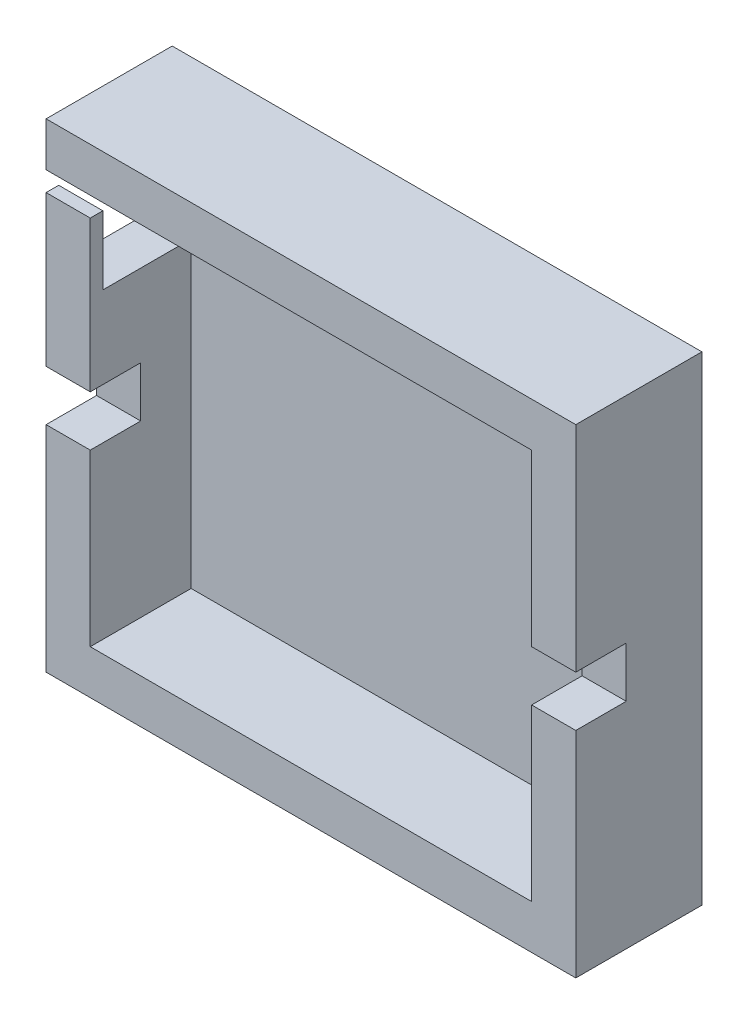
ISO-10303-21;
HEADER;
FILE_DESCRIPTION(('STEP AP214'),'2;1');
FILE_NAME('part.step','',(''),(''),'','','');
FILE_SCHEMA(('AUTOMOTIVE_DESIGN { 1 0 10303 214 1 1 1 1 }'));
ENDSEC;
DATA;
#1=APPLICATION_CONTEXT('core data for automotive mechanical design processes');
#2=APPLICATION_PROTOCOL_DEFINITION('international standard','automotive_design',2000,#1);
#3=PRODUCT_CONTEXT('',#1,'mechanical');
#4=PRODUCT('Part','Part','',(#3));
#5=PRODUCT_RELATED_PRODUCT_CATEGORY('part','',(#4));
#6=PRODUCT_DEFINITION_FORMATION('','',#4);
#7=PRODUCT_DEFINITION_CONTEXT('part definition',#1,'design');
#8=PRODUCT_DEFINITION('design','',#6,#7);
#9=PRODUCT_DEFINITION_SHAPE('','',#8);
#10=(LENGTH_UNIT() NAMED_UNIT(*) SI_UNIT(.MILLI.,.METRE.));
#11=(NAMED_UNIT(*) PLANE_ANGLE_UNIT() SI_UNIT($,.RADIAN.));
#12=(NAMED_UNIT(*) SI_UNIT($,.STERADIAN.) SOLID_ANGLE_UNIT());
#13=UNCERTAINTY_MEASURE_WITH_UNIT(LENGTH_MEASURE(1.E-05),#10,'distance_accuracy_value','');
#14=(GEOMETRIC_REPRESENTATION_CONTEXT(3) GLOBAL_UNCERTAINTY_ASSIGNED_CONTEXT((#13)) GLOBAL_UNIT_ASSIGNED_CONTEXT((#10,
#11,#12)) REPRESENTATION_CONTEXT('',''));
#15=CARTESIAN_POINT('',(0.,0.,0.));
#16=DIRECTION('',(0.,0.,1.));
#17=DIRECTION('',(1.,0.,0.));
#18=AXIS2_PLACEMENT_3D('',#15,#16,#17);
#19=CARTESIAN_POINT('',(-3.5,-3.5,2.));
#20=DIRECTION('',(1.,0.,0.));
#21=DIRECTION('',(0.,1.,0.));
#22=AXIS2_PLACEMENT_3D('',#19,#20,#21);
#23=PLANE('',#22);
#24=DIRECTION('',(0.,0.,1.));
#25=VECTOR('',#24,1.);
#26=CARTESIAN_POINT('',(-3.5,13.4999999999999,5.99999999999994));
#27=LINE('',#26,#25);
#28=CARTESIAN_POINT('',(-3.5,13.4999999999999,5.99999999999994));
#29=VERTEX_POINT('',#28);
#30=CARTESIAN_POINT('',(-3.5,13.4999999999998,10.));
#31=VERTEX_POINT('',#30);
#32=EDGE_CURVE('E260',#29,#31,#27,.T.);
#33=ORIENTED_EDGE('',*,*,#32,.F.);
#34=DIRECTION('',(0.,-1.,0.));
#35=VECTOR('',#34,1.);
#36=CARTESIAN_POINT('',(-3.5,0.,6.));
#37=LINE('',#36,#35);
#38=CARTESIAN_POINT('',(-3.5,17.4999999999998,6.));
#39=VERTEX_POINT('',#38);
#40=EDGE_CURVE('E248',#39,#29,#37,.T.);
#41=ORIENTED_EDGE('',*,*,#40,.F.);
#42=DIRECTION('',(0.,0.,1.));
#43=VECTOR('',#42,1.);
#44=CARTESIAN_POINT('',(-3.5,17.4999999999998,6.));
#45=LINE('',#44,#43);
#46=CARTESIAN_POINT('',(-3.5,17.5,10.));
#47=VERTEX_POINT('',#46);
#48=EDGE_CURVE('E264',#39,#47,#45,.T.);
#49=ORIENTED_EDGE('',*,*,#48,.T.);
#50=DIRECTION('',(0.,-1.,0.));
#51=VECTOR('',#50,1.);
#52=CARTESIAN_POINT('',(-3.5,-3.5,10.));
#53=LINE('',#52,#51);
#54=CARTESIAN_POINT('',(-3.5,29.4354205615971,9.99999999999989));
#55=VERTEX_POINT('',#54);
#56=EDGE_CURVE('E388',#55,#47,#53,.T.);
#57=ORIENTED_EDGE('',*,*,#56,.F.);
#58=DIRECTION('',(0.,0.,1.));
#59=VECTOR('',#58,1.);
#60=CARTESIAN_POINT('',(-3.5,29.4354205615971,8.99999999999989));
#61=LINE('',#60,#59);
#62=CARTESIAN_POINT('',(-3.5,29.4354205615971,8.99999999999989));
#63=VERTEX_POINT('',#62);
#64=EDGE_CURVE('E263',#63,#55,#61,.T.);
#65=ORIENTED_EDGE('',*,*,#64,.F.);
#66=DIRECTION('',(0.,-1.,0.));
#67=VECTOR('',#66,1.);
#68=CARTESIAN_POINT('',(-3.5,0.,9.));
#69=LINE('',#68,#67);
#70=CARTESIAN_POINT('',(-3.5,23.9999999999998,9.));
#71=VERTEX_POINT('',#70);
#72=EDGE_CURVE('E308',#63,#71,#69,.T.);
#73=ORIENTED_EDGE('',*,*,#72,.T.);
#74=DIRECTION('',(0.,0.,1.));
#75=VECTOR('',#74,1.);
#76=CARTESIAN_POINT('',(-3.5,23.9999999999998,0.));
#77=LINE('',#76,#75);
#78=CARTESIAN_POINT('',(-3.5,23.9999999999998,2.));
#79=VERTEX_POINT('',#78);
#80=EDGE_CURVE('E321',#79,#71,#77,.T.);
#81=ORIENTED_EDGE('',*,*,#80,.F.);
#82=DIRECTION('',(0.,-1.,0.));
#83=VECTOR('',#82,1.);
#84=CARTESIAN_POINT('',(-3.5,0.,2.));
#85=LINE('',#84,#83);
#86=CARTESIAN_POINT('',(-3.5,30.9999999999998,2.));
#87=VERTEX_POINT('',#86);
#88=EDGE_CURVE('E317',#87,#79,#85,.T.);
#89=ORIENTED_EDGE('',*,*,#88,.F.);
#90=DIRECTION('',(0.,0.,1.));
#91=VECTOR('',#90,1.);
#92=CARTESIAN_POINT('',(-3.5,30.9999999999998,0.));
#93=LINE('',#92,#91);
#94=CARTESIAN_POINT('',(-3.5,31.,10.));
#95=VERTEX_POINT('',#94);
#96=EDGE_CURVE('E312',#87,#95,#93,.T.);
#97=ORIENTED_EDGE('',*,*,#96,.T.);
#98=CARTESIAN_POINT('',(-3.5,34.5,10.));
#99=VERTEX_POINT('',#98);
#100=EDGE_CURVE('E383',#99,#95,#53,.T.);
#101=ORIENTED_EDGE('',*,*,#100,.F.);
#102=DIRECTION('',(0.,0.,-1.));
#103=VECTOR('',#102,1.);
#104=CARTESIAN_POINT('',(-3.5,34.5,2.));
#105=LINE('',#104,#103);
#106=CARTESIAN_POINT('',(-3.5,34.5,0.));
#107=VERTEX_POINT('',#106);
#108=EDGE_CURVE('E414',#99,#107,#105,.T.);
#109=ORIENTED_EDGE('',*,*,#108,.T.);
#110=DIRECTION('',(0.,-1.,0.));
#111=VECTOR('',#110,1.);
#112=CARTESIAN_POINT('',(-3.5,-3.5,0.));
#113=LINE('',#112,#111);
#114=CARTESIAN_POINT('',(-3.5,-3.5,0.));
#115=VERTEX_POINT('',#114);
#116=EDGE_CURVE('E401',#107,#115,#113,.T.);
#117=ORIENTED_EDGE('',*,*,#116,.T.);
#118=DIRECTION('',(0.,0.,-1.));
#119=VECTOR('',#118,1.);
#120=CARTESIAN_POINT('',(-3.5,-3.5,2.));
#121=LINE('',#120,#119);
#122=CARTESIAN_POINT('',(-3.5,-3.5,10.));
#123=VERTEX_POINT('',#122);
#124=EDGE_CURVE('E426',#123,#115,#121,.T.);
#125=ORIENTED_EDGE('',*,*,#124,.F.);
#126=EDGE_CURVE('E382',#31,#123,#53,.T.);
#127=ORIENTED_EDGE('',*,*,#126,.F.);
#128=EDGE_LOOP('',(#33,#41,#49,#57,#65,#73,#81,#89,#97,#101,#109,#117,#125,#127));
#129=FACE_BOUND('',#128,.T.);
#130=ADVANCED_FACE('F38',(#129),#23,.F.);
#131=CARTESIAN_POINT('',(0.,0.,10.));
#132=DIRECTION('',(0.,0.,-1.));
#133=DIRECTION('',(-1.,0.,0.));
#134=AXIS2_PLACEMENT_3D('',#131,#132,#133);
#135=PLANE('',#134);
#136=DIRECTION('',(-1.,0.,0.));
#137=VECTOR('',#136,1.);
#138=CARTESIAN_POINT('',(0.,13.4999999999998,10.));
#139=LINE('',#138,#137);
#140=CARTESIAN_POINT('',(0.,13.4999999999998,10.));
#141=VERTEX_POINT('',#140);
#142=EDGE_CURVE('E253',#141,#31,#139,.T.);
#143=ORIENTED_EDGE('',*,*,#142,.T.);
#144=ORIENTED_EDGE('',*,*,#126,.T.);
#145=DIRECTION('',(1.,0.,0.));
#146=VECTOR('',#145,1.);
#147=CARTESIAN_POINT('',(-3.5,-3.5,10.));
#148=LINE('',#147,#146);
#149=CARTESIAN_POINT('',(38.5,-3.5,10.));
#150=VERTEX_POINT('',#149);
#151=EDGE_CURVE('E387',#123,#150,#148,.T.);
#152=ORIENTED_EDGE('',*,*,#151,.T.);
#153=DIRECTION('',(0.,1.,0.));
#154=VECTOR('',#153,1.);
#155=CARTESIAN_POINT('',(38.5,-3.5,10.));
#156=LINE('',#155,#154);
#157=CARTESIAN_POINT('',(38.5,13.4999999999998,10.));
#158=VERTEX_POINT('',#157);
#159=EDGE_CURVE('E393',#150,#158,#156,.T.);
#160=ORIENTED_EDGE('',*,*,#159,.T.);
#161=DIRECTION('',(1.,0.,0.));
#162=VECTOR('',#161,1.);
#163=CARTESIAN_POINT('',(0.,13.4999999999998,10.));
#164=LINE('',#163,#162);
#165=CARTESIAN_POINT('',(35.,13.4999999999998,10.));
#166=VERTEX_POINT('',#165);
#167=EDGE_CURVE('E231',#166,#158,#164,.T.);
#168=ORIENTED_EDGE('',*,*,#167,.F.);
#169=DIRECTION('',(0.,1.,0.));
#170=VECTOR('',#169,1.);
#171=CARTESIAN_POINT('',(35.,0.,10.));
#172=LINE('',#171,#170);
#173=CARTESIAN_POINT('',(35.,0.,10.));
#174=VERTEX_POINT('',#173);
#175=EDGE_CURVE('E352',#174,#166,#172,.T.);
#176=ORIENTED_EDGE('',*,*,#175,.F.);
#177=DIRECTION('',(1.,0.,0.));
#178=VECTOR('',#177,1.);
#179=CARTESIAN_POINT('',(0.,0.,10.));
#180=LINE('',#179,#178);
#181=CARTESIAN_POINT('',(0.,0.,10.));
#182=VERTEX_POINT('',#181);
#183=EDGE_CURVE('E347',#182,#174,#180,.T.);
#184=ORIENTED_EDGE('',*,*,#183,.F.);
#185=DIRECTION('',(0.,-1.,0.));
#186=VECTOR('',#185,1.);
#187=CARTESIAN_POINT('',(0.,0.,10.));
#188=LINE('',#187,#186);
#189=EDGE_CURVE('E348',#141,#182,#188,.T.);
#190=ORIENTED_EDGE('',*,*,#189,.F.);
#191=EDGE_LOOP('',(#143,#144,#152,#160,#168,#176,#184,#190));
#192=FACE_BOUND('',#191,.T.);
#193=ADVANCED_FACE('F467',(#192),#135,.F.);
#194=DIRECTION('',(1.,0.,0.));
#195=VECTOR('',#194,1.);
#196=CARTESIAN_POINT('',(0.,17.5,10.));
#197=LINE('',#196,#195);
#198=CARTESIAN_POINT('',(35.,17.5,10.));
#199=VERTEX_POINT('',#198);
#200=CARTESIAN_POINT('',(38.5,17.5,9.99999999999989));
#201=VERTEX_POINT('',#200);
#202=EDGE_CURVE('E279',#199,#201,#197,.T.);
#203=ORIENTED_EDGE('',*,*,#202,.T.);
#204=CARTESIAN_POINT('',(38.5,34.4999999999996,9.99999999999989));
#205=VERTEX_POINT('',#204);
#206=EDGE_CURVE('E392',#201,#205,#156,.T.);
#207=ORIENTED_EDGE('',*,*,#206,.T.);
#208=DIRECTION('',(-1.,0.,0.));
#209=VECTOR('',#208,1.);
#210=CARTESIAN_POINT('',(-3.5,34.5,10.));
#211=LINE('',#210,#209);
#212=EDGE_CURVE('E397',#205,#99,#211,.T.);
#213=ORIENTED_EDGE('',*,*,#212,.T.);
#214=ORIENTED_EDGE('',*,*,#100,.T.);
#215=DIRECTION('',(-1.,0.,0.));
#216=VECTOR('',#215,1.);
#217=CARTESIAN_POINT('',(0.,31.,10.));
#218=LINE('',#217,#216);
#219=CARTESIAN_POINT('',(35.,31.,10.));
#220=VERTEX_POINT('',#219);
#221=EDGE_CURVE('E356',#220,#95,#218,.T.);
#222=ORIENTED_EDGE('',*,*,#221,.F.);
#223=EDGE_CURVE('E351',#199,#220,#172,.T.);
#224=ORIENTED_EDGE('',*,*,#223,.F.);
#225=EDGE_LOOP('',(#203,#207,#213,#214,#222,#224));
#226=FACE_BOUND('',#225,.T.);
#227=ADVANCED_FACE('F472',(#226),#135,.F.);
#228=CARTESIAN_POINT('',(38.5,-3.5,1.99999999999989));
#229=DIRECTION('',(-1.,0.,0.));
#230=DIRECTION('',(0.,0.,1.));
#231=AXIS2_PLACEMENT_3D('',#228,#229,#230);
#232=PLANE('',#231);
#233=DIRECTION('',(0.,0.,1.));
#234=VECTOR('',#233,1.);
#235=CARTESIAN_POINT('',(38.5,17.4999999999998,5.99999999999994));
#236=LINE('',#235,#234);
#237=CARTESIAN_POINT('',(38.5,17.4999999999998,5.99999999999994));
#238=VERTEX_POINT('',#237);
#239=EDGE_CURVE('E299',#238,#201,#236,.T.);
#240=ORIENTED_EDGE('',*,*,#239,.F.);
#241=DIRECTION('',(0.,1.,0.));
#242=VECTOR('',#241,1.);
#243=CARTESIAN_POINT('',(38.5,0.,5.99999999999994));
#244=LINE('',#243,#242);
#245=CARTESIAN_POINT('',(38.5,13.4999999999999,5.99999999999994));
#246=VERTEX_POINT('',#245);
#247=EDGE_CURVE('E283',#246,#238,#244,.T.);
#248=ORIENTED_EDGE('',*,*,#247,.F.);
#249=DIRECTION('',(0.,0.,1.));
#250=VECTOR('',#249,1.);
#251=CARTESIAN_POINT('',(38.5,13.4999999999999,5.99999999999994));
#252=LINE('',#251,#250);
#253=EDGE_CURVE('E302',#246,#158,#252,.T.);
#254=ORIENTED_EDGE('',*,*,#253,.T.);
#255=ORIENTED_EDGE('',*,*,#159,.F.);
#256=DIRECTION('',(0.,0.,-1.));
#257=VECTOR('',#256,1.);
#258=CARTESIAN_POINT('',(38.5,-3.5,1.99999999999989));
#259=LINE('',#258,#257);
#260=CARTESIAN_POINT('',(38.5,-3.5,-1.11022302462516E-13));
#261=VERTEX_POINT('',#260);
#262=EDGE_CURVE('E422',#150,#261,#259,.T.);
#263=ORIENTED_EDGE('',*,*,#262,.T.);
#264=DIRECTION('',(0.,1.,0.));
#265=VECTOR('',#264,1.);
#266=CARTESIAN_POINT('',(38.5,-3.5,-1.11022302462516E-13));
#267=LINE('',#266,#265);
#268=CARTESIAN_POINT('',(38.5,34.4999999999996,-1.11022302462516E-13));
#269=VERTEX_POINT('',#268);
#270=EDGE_CURVE('E408',#261,#269,#267,.T.);
#271=ORIENTED_EDGE('',*,*,#270,.T.);
#272=DIRECTION('',(0.,0.,-1.));
#273=VECTOR('',#272,1.);
#274=CARTESIAN_POINT('',(38.5,34.4999999999996,2.));
#275=LINE('',#274,#273);
#276=EDGE_CURVE('E418',#205,#269,#275,.T.);
#277=ORIENTED_EDGE('',*,*,#276,.F.);
#278=ORIENTED_EDGE('',*,*,#206,.F.);
#279=EDGE_LOOP('',(#240,#248,#254,#255,#263,#271,#277,#278));
#280=FACE_BOUND('',#279,.T.);
#281=ADVANCED_FACE('F569',(#280),#232,.F.);
#282=CARTESIAN_POINT('',(0.,0.,10.));
#283=DIRECTION('',(1.,0.,0.));
#284=DIRECTION('',(0.,0.,-1.));
#285=AXIS2_PLACEMENT_3D('',#282,#283,#284);
#286=PLANE('',#285);
#287=DIRECTION('',(0.,1.,0.));
#288=VECTOR('',#287,1.);
#289=CARTESIAN_POINT('',(0.,0.,5.99999999999994));
#290=LINE('',#289,#288);
#291=CARTESIAN_POINT('',(0.,13.4999999999999,6.));
#292=VERTEX_POINT('',#291);
#293=CARTESIAN_POINT('',(0.,17.4999999999998,5.99999999999994));
#294=VERTEX_POINT('',#293);
#295=EDGE_CURVE('E239',#292,#294,#290,.T.);
#296=ORIENTED_EDGE('',*,*,#295,.F.);
#297=DIRECTION('',(0.,0.,1.));
#298=VECTOR('',#297,1.);
#299=CARTESIAN_POINT('',(0.,13.4999999999999,6.));
#300=LINE('',#299,#298);
#301=EDGE_CURVE('E252',#292,#141,#300,.T.);
#302=ORIENTED_EDGE('',*,*,#301,.T.);
#303=ORIENTED_EDGE('',*,*,#189,.T.);
#304=DIRECTION('',(0.,0.,-1.));
#305=VECTOR('',#304,1.);
#306=CARTESIAN_POINT('',(0.,0.,10.));
#307=LINE('',#306,#305);
#308=CARTESIAN_POINT('',(0.,0.,2.));
#309=VERTEX_POINT('',#308);
#310=EDGE_CURVE('E378',#182,#309,#307,.T.);
#311=ORIENTED_EDGE('',*,*,#310,.T.);
#312=DIRECTION('',(0.,-1.,0.));
#313=VECTOR('',#312,1.);
#314=CARTESIAN_POINT('',(0.,0.,2.));
#315=LINE('',#314,#313);
#316=CARTESIAN_POINT('',(0.,23.9999999999998,2.));
#317=VERTEX_POINT('',#316);
#318=EDGE_CURVE('E342',#317,#309,#315,.T.);
#319=ORIENTED_EDGE('',*,*,#318,.F.);
#320=DIRECTION('',(0.,0.,-1.));
#321=VECTOR('',#320,1.);
#322=CARTESIAN_POINT('',(0.,23.9999999999998,9.99999999999989));
#323=LINE('',#322,#321);
#324=CARTESIAN_POINT('',(0.,23.9999999999998,8.99999999999989));
#325=VERTEX_POINT('',#324);
#326=EDGE_CURVE('E336',#325,#317,#323,.T.);
#327=ORIENTED_EDGE('',*,*,#326,.F.);
#328=DIRECTION('',(0.,1.,0.));
#329=VECTOR('',#328,1.);
#330=CARTESIAN_POINT('',(0.,0.,9.));
#331=LINE('',#330,#329);
#332=CARTESIAN_POINT('',(0.,29.4354205615971,9.));
#333=VERTEX_POINT('',#332);
#334=EDGE_CURVE('E433',#325,#333,#331,.T.);
#335=ORIENTED_EDGE('',*,*,#334,.T.);
#336=DIRECTION('',(0.,0.,-1.));
#337=VECTOR('',#336,1.);
#338=CARTESIAN_POINT('',(0.,29.4354205615971,10.));
#339=LINE('',#338,#337);
#340=CARTESIAN_POINT('',(0.,29.4354205615971,10.));
#341=VERTEX_POINT('',#340);
#342=EDGE_CURVE('E430',#341,#333,#339,.T.);
#343=ORIENTED_EDGE('',*,*,#342,.F.);
#344=CARTESIAN_POINT('',(0.,17.5,10.));
#345=VERTEX_POINT('',#344);
#346=EDGE_CURVE('E343',#341,#345,#188,.T.);
#347=ORIENTED_EDGE('',*,*,#346,.T.);
#348=DIRECTION('',(0.,0.,1.));
#349=VECTOR('',#348,1.);
#350=CARTESIAN_POINT('',(0.,17.4999999999998,5.99999999999994));
#351=LINE('',#350,#349);
#352=EDGE_CURVE('E268',#294,#345,#351,.T.);
#353=ORIENTED_EDGE('',*,*,#352,.F.);
#354=EDGE_LOOP('',(#296,#302,#303,#311,#319,#327,#335,#343,#347,#353));
#355=FACE_BOUND('',#354,.T.);
#356=ADVANCED_FACE('F597',(#355),#286,.T.);
#357=CARTESIAN_POINT('',(35.,0.,10.));
#358=DIRECTION('',(-1.,0.,0.));
#359=DIRECTION('',(0.,0.,1.));
#360=AXIS2_PLACEMENT_3D('',#357,#358,#359);
#361=PLANE('',#360);
#362=DIRECTION('',(0.,-1.,0.));
#363=VECTOR('',#362,1.);
#364=CARTESIAN_POINT('',(35.,0.,5.99999999999994));
#365=LINE('',#364,#363);
#366=CARTESIAN_POINT('',(35.,17.5,6.));
#367=VERTEX_POINT('',#366);
#368=CARTESIAN_POINT('',(35.,13.4999999999999,5.99999999999994));
#369=VERTEX_POINT('',#368);
#370=EDGE_CURVE('E274',#367,#369,#365,.T.);
#371=ORIENTED_EDGE('',*,*,#370,.F.);
#372=DIRECTION('',(0.,0.,1.));
#373=VECTOR('',#372,1.);
#374=CARTESIAN_POINT('',(35.,17.5,6.));
#375=LINE('',#374,#373);
#376=EDGE_CURVE('E257',#367,#199,#375,.T.);
#377=ORIENTED_EDGE('',*,*,#376,.T.);
#378=ORIENTED_EDGE('',*,*,#223,.T.);
#379=DIRECTION('',(0.,0.,-1.));
#380=VECTOR('',#379,1.);
#381=CARTESIAN_POINT('',(35.,31.,10.));
#382=LINE('',#381,#380);
#383=CARTESIAN_POINT('',(35.,30.9999999999998,2.));
#384=VERTEX_POINT('',#383);
#385=EDGE_CURVE('E359',#220,#384,#382,.T.);
#386=ORIENTED_EDGE('',*,*,#385,.T.);
#387=DIRECTION('',(0.,1.,0.));
#388=VECTOR('',#387,1.);
#389=CARTESIAN_POINT('',(35.,0.,1.99999999999989));
#390=LINE('',#389,#388);
#391=CARTESIAN_POINT('',(35.,0.,1.99999999999989));
#392=VERTEX_POINT('',#391);
#393=EDGE_CURVE('E366',#392,#384,#390,.T.);
#394=ORIENTED_EDGE('',*,*,#393,.F.);
#395=DIRECTION('',(0.,0.,-1.));
#396=VECTOR('',#395,1.);
#397=CARTESIAN_POINT('',(35.,0.,10.));
#398=LINE('',#397,#396);
#399=EDGE_CURVE('E375',#174,#392,#398,.T.);
#400=ORIENTED_EDGE('',*,*,#399,.F.);
#401=ORIENTED_EDGE('',*,*,#175,.T.);
#402=DIRECTION('',(0.,0.,1.));
#403=VECTOR('',#402,1.);
#404=CARTESIAN_POINT('',(35.,13.4999999999999,5.99999999999994));
#405=LINE('',#404,#403);
#406=EDGE_CURVE('E290',#369,#166,#405,.T.);
#407=ORIENTED_EDGE('',*,*,#406,.F.);
#408=EDGE_LOOP('',(#371,#377,#378,#386,#394,#400,#401,#407));
#409=FACE_BOUND('',#408,.T.);
#410=ADVANCED_FACE('F589',(#409),#361,.T.);
#411=ORIENTED_EDGE('',*,*,#56,.T.);
#412=DIRECTION('',(-1.,0.,0.));
#413=VECTOR('',#412,1.);
#414=CARTESIAN_POINT('',(0.,17.5,10.));
#415=LINE('',#414,#413);
#416=EDGE_CURVE('E240',#345,#47,#415,.T.);
#417=ORIENTED_EDGE('',*,*,#416,.F.);
#418=ORIENTED_EDGE('',*,*,#346,.F.);
#419=DIRECTION('',(-1.,0.,0.));
#420=VECTOR('',#419,1.);
#421=CARTESIAN_POINT('',(3.,29.4354205615971,10.));
#422=LINE('',#421,#420);
#423=EDGE_CURVE('E313',#341,#55,#422,.T.);
#424=ORIENTED_EDGE('',*,*,#423,.T.);
#425=EDGE_LOOP('',(#411,#417,#418,#424));
#426=FACE_BOUND('',#425,.T.);
#427=ADVANCED_FACE('F475',(#426),#135,.F.);
#428=CARTESIAN_POINT('',(-3.5,-3.5,2.));
#429=DIRECTION('',(0.,1.,0.));
#430=DIRECTION('',(0.,0.,1.));
#431=AXIS2_PLACEMENT_3D('',#428,#429,#430);
#432=PLANE('',#431);
#433=DIRECTION('',(1.,0.,0.));
#434=VECTOR('',#433,1.);
#435=CARTESIAN_POINT('',(-3.5,-3.5,0.));
#436=LINE('',#435,#434);
#437=EDGE_CURVE('E405',#115,#261,#436,.T.);
#438=ORIENTED_EDGE('',*,*,#437,.T.);
#439=ORIENTED_EDGE('',*,*,#262,.F.);
#440=ORIENTED_EDGE('',*,*,#151,.F.);
#441=ORIENTED_EDGE('',*,*,#124,.T.);
#442=EDGE_LOOP('',(#438,#439,#440,#441));
#443=FACE_BOUND('',#442,.T.);
#444=ADVANCED_FACE('F577',(#443),#432,.F.);
#445=CARTESIAN_POINT('',(-3.5,34.5,2.));
#446=DIRECTION('',(0.,-1.,0.));
#447=DIRECTION('',(0.,0.,-1.));
#448=AXIS2_PLACEMENT_3D('',#445,#446,#447);
#449=PLANE('',#448);
#450=DIRECTION('',(-1.,0.,0.));
#451=VECTOR('',#450,1.);
#452=CARTESIAN_POINT('',(-3.5,34.5,0.));
#453=LINE('',#452,#451);
#454=EDGE_CURVE('E411',#269,#107,#453,.T.);
#455=ORIENTED_EDGE('',*,*,#454,.T.);
#456=ORIENTED_EDGE('',*,*,#108,.F.);
#457=ORIENTED_EDGE('',*,*,#212,.F.);
#458=ORIENTED_EDGE('',*,*,#276,.T.);
#459=EDGE_LOOP('',(#455,#456,#457,#458));
#460=FACE_BOUND('',#459,.T.);
#461=ADVANCED_FACE('F573',(#460),#449,.F.);
#462=CARTESIAN_POINT('',(0.,0.,0.));
#463=DIRECTION('',(0.,0.,-1.));
#464=DIRECTION('',(-1.,0.,0.));
#465=AXIS2_PLACEMENT_3D('',#462,#463,#464);
#466=PLANE('',#465);
#467=DIRECTION('',(0.,-1.,0.));
#468=VECTOR('',#467,1.);
#469=CARTESIAN_POINT('',(28.,0.,0.));
#470=LINE('',#469,#468);
#471=CARTESIAN_POINT('',(28.,28.1,-1.11022302462516E-13));
#472=VERTEX_POINT('',#471);
#473=CARTESIAN_POINT('',(28.,23.8999999999998,-1.11022302462516E-13));
#474=VERTEX_POINT('',#473);
#475=EDGE_CURVE('E53',#472,#474,#470,.T.);
#476=ORIENTED_EDGE('',*,*,#475,.F.);
#477=DIRECTION('',(-1.,0.,0.));
#478=VECTOR('',#477,1.);
#479=CARTESIAN_POINT('',(0.,28.0999999999998,0.));
#480=LINE('',#479,#478);
#481=CARTESIAN_POINT('',(5.,28.0999999999998,0.));
#482=VERTEX_POINT('',#481);
#483=EDGE_CURVE('E220',#472,#482,#480,.T.);
#484=ORIENTED_EDGE('',*,*,#483,.T.);
#485=DIRECTION('',(0.,-1.,0.));
#486=VECTOR('',#485,1.);
#487=CARTESIAN_POINT('',(4.99999999999999,-2.22044604925031E-13,-1.11022302462516E-13));
#488=LINE('',#487,#486);
#489=CARTESIAN_POINT('',(5.,23.8999999999998,0.));
#490=VERTEX_POINT('',#489);
#491=EDGE_CURVE('E202',#482,#490,#488,.T.);
#492=ORIENTED_EDGE('',*,*,#491,.T.);
#493=DIRECTION('',(-1.,0.,0.));
#494=VECTOR('',#493,1.);
#495=CARTESIAN_POINT('',(0.,23.8999999999998,-1.11022302462516E-13));
#496=LINE('',#495,#494);
#497=EDGE_CURVE('E212',#474,#490,#496,.T.);
#498=ORIENTED_EDGE('',*,*,#497,.F.);
#499=EDGE_LOOP('',(#476,#484,#492,#498));
#500=FACE_BOUND('',#499,.T.);
#501=ORIENTED_EDGE('',*,*,#116,.F.);
#502=ORIENTED_EDGE('',*,*,#454,.F.);
#503=ORIENTED_EDGE('',*,*,#270,.F.);
#504=ORIENTED_EDGE('',*,*,#437,.F.);
#505=EDGE_LOOP('',(#501,#502,#503,#504));
#506=FACE_BOUND('',#505,.T.);
#507=ADVANCED_FACE('F217',(#500,#506),#466,.T.);
#508=CARTESIAN_POINT('',(0.,0.,10.));
#509=DIRECTION('',(0.,1.,0.));
#510=DIRECTION('',(0.,0.,1.));
#511=AXIS2_PLACEMENT_3D('',#508,#509,#510);
#512=PLANE('',#511);
#513=DIRECTION('',(1.,0.,0.));
#514=VECTOR('',#513,1.);
#515=CARTESIAN_POINT('',(0.,0.,2.));
#516=LINE('',#515,#514);
#517=EDGE_CURVE('E362',#309,#392,#516,.T.);
#518=ORIENTED_EDGE('',*,*,#517,.F.);
#519=ORIENTED_EDGE('',*,*,#310,.F.);
#520=ORIENTED_EDGE('',*,*,#183,.T.);
#521=ORIENTED_EDGE('',*,*,#399,.T.);
#522=EDGE_LOOP('',(#518,#519,#520,#521));
#523=FACE_BOUND('',#522,.T.);
#524=ADVANCED_FACE('F594',(#523),#512,.T.);
#525=CARTESIAN_POINT('',(0.,31.,10.));
#526=DIRECTION('',(0.,-1.,0.));
#527=DIRECTION('',(0.,0.,-1.));
#528=AXIS2_PLACEMENT_3D('',#525,#526,#527);
#529=PLANE('',#528);
#530=ORIENTED_EDGE('',*,*,#96,.F.);
#531=DIRECTION('',(-1.,0.,0.));
#532=VECTOR('',#531,1.);
#533=CARTESIAN_POINT('',(0.,30.9999999999998,2.));
#534=LINE('',#533,#532);
#535=EDGE_CURVE('E370',#384,#87,#534,.T.);
#536=ORIENTED_EDGE('',*,*,#535,.F.);
#537=ORIENTED_EDGE('',*,*,#385,.F.);
#538=ORIENTED_EDGE('',*,*,#221,.T.);
#539=EDGE_LOOP('',(#530,#536,#537,#538));
#540=FACE_BOUND('',#539,.T.);
#541=ADVANCED_FACE('F631',(#540),#529,.T.);
#542=CARTESIAN_POINT('',(0.,0.,2.));
#543=DIRECTION('',(0.,0.,-1.));
#544=DIRECTION('',(-1.,0.,0.));
#545=AXIS2_PLACEMENT_3D('',#542,#543,#544);
#546=PLANE('',#545);
#547=DIRECTION('',(-1.,0.,0.));
#548=VECTOR('',#547,1.);
#549=CARTESIAN_POINT('',(0.,28.0999999999998,2.));
#550=LINE('',#549,#548);
#551=CARTESIAN_POINT('',(28.,28.1,2.));
#552=VERTEX_POINT('',#551);
#553=CARTESIAN_POINT('',(5.,28.0999999999998,2.));
#554=VERTEX_POINT('',#553);
#555=EDGE_CURVE('E46',#552,#554,#550,.T.);
#556=ORIENTED_EDGE('',*,*,#555,.F.);
#557=DIRECTION('',(0.,-1.,0.));
#558=VECTOR('',#557,1.);
#559=CARTESIAN_POINT('',(28.,0.,2.));
#560=LINE('',#559,#558);
#561=CARTESIAN_POINT('',(28.,23.9,1.99999999999989));
#562=VERTEX_POINT('',#561);
#563=EDGE_CURVE('E11',#552,#562,#560,.T.);
#564=ORIENTED_EDGE('',*,*,#563,.T.);
#565=DIRECTION('',(-1.,0.,0.));
#566=VECTOR('',#565,1.);
#567=CARTESIAN_POINT('',(0.,23.8999999999998,2.));
#568=LINE('',#567,#566);
#569=CARTESIAN_POINT('',(5.,23.8999999999998,2.));
#570=VERTEX_POINT('',#569);
#571=EDGE_CURVE('E437',#562,#570,#568,.T.);
#572=ORIENTED_EDGE('',*,*,#571,.T.);
#573=DIRECTION('',(0.,-1.,0.));
#574=VECTOR('',#573,1.);
#575=CARTESIAN_POINT('',(4.99999999999999,-2.22044604925031E-13,1.99999999999989));
#576=LINE('',#575,#574);
#577=EDGE_CURVE('E205',#554,#570,#576,.T.);
#578=ORIENTED_EDGE('',*,*,#577,.F.);
#579=EDGE_LOOP('',(#556,#564,#572,#578));
#580=FACE_BOUND('',#579,.T.);
#581=ORIENTED_EDGE('',*,*,#535,.T.);
#582=ORIENTED_EDGE('',*,*,#88,.T.);
#583=DIRECTION('',(-1.,0.,0.));
#584=VECTOR('',#583,1.);
#585=CARTESIAN_POINT('',(3.,23.9999999999998,2.));
#586=LINE('',#585,#584);
#587=EDGE_CURVE('E325',#317,#79,#586,.T.);
#588=ORIENTED_EDGE('',*,*,#587,.F.);
#589=ORIENTED_EDGE('',*,*,#318,.T.);
#590=ORIENTED_EDGE('',*,*,#517,.T.);
#591=ORIENTED_EDGE('',*,*,#393,.T.);
#592=EDGE_LOOP('',(#581,#582,#588,#589,#590,#591));
#593=FACE_BOUND('',#592,.T.);
#594=ADVANCED_FACE('F448',(#580,#593),#546,.F.);
#595=CARTESIAN_POINT('',(3.,23.9999999999998,0.));
#596=DIRECTION('',(0.,-1.,0.));
#597=DIRECTION('',(1.,0.,0.));
#598=AXIS2_PLACEMENT_3D('',#595,#596,#597);
#599=PLANE('',#598);
#600=ORIENTED_EDGE('',*,*,#326,.T.);
#601=ORIENTED_EDGE('',*,*,#587,.T.);
#602=ORIENTED_EDGE('',*,*,#80,.T.);
#603=DIRECTION('',(-1.,0.,0.));
#604=VECTOR('',#603,1.);
#605=CARTESIAN_POINT('',(3.,23.9999999999998,9.));
#606=LINE('',#605,#604);
#607=EDGE_CURVE('E326',#325,#71,#606,.T.);
#608=ORIENTED_EDGE('',*,*,#607,.F.);
#609=EDGE_LOOP('',(#600,#601,#602,#608));
#610=FACE_BOUND('',#609,.T.);
#611=ADVANCED_FACE('F603',(#610),#599,.F.);
#612=CARTESIAN_POINT('',(3.,-2.22044604925031E-13,9.));
#613=DIRECTION('',(0.,0.,-1.));
#614=DIRECTION('',(-1.,0.,0.));
#615=AXIS2_PLACEMENT_3D('',#612,#613,#614);
#616=PLANE('',#615);
#617=ORIENTED_EDGE('',*,*,#607,.T.);
#618=ORIENTED_EDGE('',*,*,#72,.F.);
#619=DIRECTION('',(-1.,0.,0.));
#620=VECTOR('',#619,1.);
#621=CARTESIAN_POINT('',(3.,29.4354205615971,9.));
#622=LINE('',#621,#620);
#623=EDGE_CURVE('E329',#333,#63,#622,.T.);
#624=ORIENTED_EDGE('',*,*,#623,.F.);
#625=ORIENTED_EDGE('',*,*,#334,.F.);
#626=EDGE_LOOP('',(#617,#618,#624,#625));
#627=FACE_BOUND('',#626,.T.);
#628=ADVANCED_FACE('F607',(#627),#616,.T.);
#629=CARTESIAN_POINT('',(3.,29.4354205615971,9.));
#630=DIRECTION('',(0.,-1.,0.));
#631=DIRECTION('',(1.,0.,0.));
#632=AXIS2_PLACEMENT_3D('',#629,#630,#631);
#633=PLANE('',#632);
#634=ORIENTED_EDGE('',*,*,#342,.T.);
#635=ORIENTED_EDGE('',*,*,#623,.T.);
#636=ORIENTED_EDGE('',*,*,#64,.T.);
#637=ORIENTED_EDGE('',*,*,#423,.F.);
#638=EDGE_LOOP('',(#634,#635,#636,#637));
#639=FACE_BOUND('',#638,.T.);
#640=ADVANCED_FACE('F618',(#639),#633,.F.);
#641=CARTESIAN_POINT('',(0.,17.4999999999998,5.99999999999994));
#642=DIRECTION('',(0.,-1.,0.));
#643=DIRECTION('',(0.,0.,-1.));
#644=AXIS2_PLACEMENT_3D('',#641,#642,#643);
#645=PLANE('',#644);
#646=ORIENTED_EDGE('',*,*,#202,.F.);
#647=ORIENTED_EDGE('',*,*,#376,.F.);
#648=DIRECTION('',(1.,0.,0.));
#649=VECTOR('',#648,1.);
#650=CARTESIAN_POINT('',(0.,17.4999999999998,5.99999999999994));
#651=LINE('',#650,#649);
#652=EDGE_CURVE('E287',#367,#238,#651,.T.);
#653=ORIENTED_EDGE('',*,*,#652,.T.);
#654=ORIENTED_EDGE('',*,*,#239,.T.);
#655=EDGE_LOOP('',(#646,#647,#653,#654));
#656=FACE_BOUND('',#655,.T.);
#657=ADVANCED_FACE('F620',(#656),#645,.T.);
#658=CARTESIAN_POINT('',(0.,13.4999999999999,6.));
#659=DIRECTION('',(0.,-1.,0.));
#660=DIRECTION('',(0.,0.,-1.));
#661=AXIS2_PLACEMENT_3D('',#658,#659,#660);
#662=PLANE('',#661);
#663=ORIENTED_EDGE('',*,*,#167,.T.);
#664=ORIENTED_EDGE('',*,*,#253,.F.);
#665=DIRECTION('',(1.,0.,0.));
#666=VECTOR('',#665,1.);
#667=CARTESIAN_POINT('',(0.,13.4999999999999,6.));
#668=LINE('',#667,#666);
#669=EDGE_CURVE('E278',#369,#246,#668,.T.);
#670=ORIENTED_EDGE('',*,*,#669,.F.);
#671=ORIENTED_EDGE('',*,*,#406,.T.);
#672=EDGE_LOOP('',(#663,#664,#670,#671));
#673=FACE_BOUND('',#672,.T.);
#674=ADVANCED_FACE('F582',(#673),#662,.F.);
#675=CARTESIAN_POINT('',(0.,0.,5.99999999999994));
#676=DIRECTION('',(0.,0.,1.));
#677=DIRECTION('',(1.,0.,0.));
#678=AXIS2_PLACEMENT_3D('',#675,#676,#677);
#679=PLANE('',#678);
#680=ORIENTED_EDGE('',*,*,#370,.T.);
#681=ORIENTED_EDGE('',*,*,#669,.T.);
#682=ORIENTED_EDGE('',*,*,#247,.T.);
#683=ORIENTED_EDGE('',*,*,#652,.F.);
#684=EDGE_LOOP('',(#680,#681,#682,#683));
#685=FACE_BOUND('',#684,.T.);
#686=ADVANCED_FACE('F584',(#685),#679,.T.);
#687=CARTESIAN_POINT('',(0.,13.4999999999999,6.));
#688=DIRECTION('',(0.,1.,0.));
#689=DIRECTION('',(0.,0.,1.));
#690=AXIS2_PLACEMENT_3D('',#687,#688,#689);
#691=PLANE('',#690);
#692=ORIENTED_EDGE('',*,*,#142,.F.);
#693=ORIENTED_EDGE('',*,*,#301,.F.);
#694=DIRECTION('',(-1.,0.,0.));
#695=VECTOR('',#694,1.);
#696=CARTESIAN_POINT('',(0.,13.4999999999999,6.));
#697=LINE('',#696,#695);
#698=EDGE_CURVE('E236',#292,#29,#697,.T.);
#699=ORIENTED_EDGE('',*,*,#698,.T.);
#700=ORIENTED_EDGE('',*,*,#32,.T.);
#701=EDGE_LOOP('',(#692,#693,#699,#700));
#702=FACE_BOUND('',#701,.T.);
#703=ADVANCED_FACE('F481',(#702),#691,.T.);
#704=CARTESIAN_POINT('',(0.,17.4999999999998,5.99999999999994));
#705=DIRECTION('',(0.,1.,0.));
#706=DIRECTION('',(0.,0.,1.));
#707=AXIS2_PLACEMENT_3D('',#704,#705,#706);
#708=PLANE('',#707);
#709=ORIENTED_EDGE('',*,*,#416,.T.);
#710=ORIENTED_EDGE('',*,*,#48,.F.);
#711=DIRECTION('',(-1.,0.,0.));
#712=VECTOR('',#711,1.);
#713=CARTESIAN_POINT('',(0.,17.4999999999998,5.99999999999994));
#714=LINE('',#713,#712);
#715=EDGE_CURVE('E244',#294,#39,#714,.T.);
#716=ORIENTED_EDGE('',*,*,#715,.F.);
#717=ORIENTED_EDGE('',*,*,#352,.T.);
#718=EDGE_LOOP('',(#709,#710,#716,#717));
#719=FACE_BOUND('',#718,.T.);
#720=ADVANCED_FACE('F462',(#719),#708,.F.);
#721=CARTESIAN_POINT('',(0.,0.,5.99999999999994));
#722=DIRECTION('',(0.,0.,1.));
#723=DIRECTION('',(1.,0.,0.));
#724=AXIS2_PLACEMENT_3D('',#721,#722,#723);
#725=PLANE('',#724);
#726=ORIENTED_EDGE('',*,*,#698,.F.);
#727=ORIENTED_EDGE('',*,*,#295,.T.);
#728=ORIENTED_EDGE('',*,*,#715,.T.);
#729=ORIENTED_EDGE('',*,*,#40,.T.);
#730=EDGE_LOOP('',(#726,#727,#728,#729));
#731=FACE_BOUND('',#730,.T.);
#732=ADVANCED_FACE('F455',(#731),#725,.T.);
#733=CARTESIAN_POINT('',(28.,-2.67147415300428E-13,10.));
#734=DIRECTION('',(1.,0.,0.));
#735=DIRECTION('',(0.,1.,0.));
#736=AXIS2_PLACEMENT_3D('',#733,#734,#735);
#737=PLANE('',#736);
#738=DIRECTION('',(0.,0.,-1.));
#739=VECTOR('',#738,1.);
#740=CARTESIAN_POINT('',(28.,28.1,9.99999999999989));
#741=LINE('',#740,#739);
#742=EDGE_CURVE('E228',#552,#472,#741,.T.);
#743=ORIENTED_EDGE('',*,*,#742,.T.);
#744=ORIENTED_EDGE('',*,*,#475,.T.);
#745=DIRECTION('',(0.,0.,-1.));
#746=VECTOR('',#745,1.);
#747=CARTESIAN_POINT('',(28.,23.9,10.));
#748=LINE('',#747,#746);
#749=EDGE_CURVE('E209',#562,#474,#748,.T.);
#750=ORIENTED_EDGE('',*,*,#749,.F.);
#751=ORIENTED_EDGE('',*,*,#563,.F.);
#752=EDGE_LOOP('',(#743,#744,#750,#751));
#753=FACE_BOUND('',#752,.T.);
#754=ADVANCED_FACE('F450',(#753),#737,.F.);
#755=CARTESIAN_POINT('',(0.,28.1,10.));
#756=DIRECTION('',(0.,-1.,0.));
#757=DIRECTION('',(0.,0.,-1.));
#758=AXIS2_PLACEMENT_3D('',#755,#756,#757);
#759=PLANE('',#758);
#760=ORIENTED_EDGE('',*,*,#555,.T.);
#761=DIRECTION('',(0.,0.,-1.));
#762=VECTOR('',#761,1.);
#763=CARTESIAN_POINT('',(5.,28.1,10.));
#764=LINE('',#763,#762);
#765=EDGE_CURVE('E208',#554,#482,#764,.T.);
#766=ORIENTED_EDGE('',*,*,#765,.T.);
#767=ORIENTED_EDGE('',*,*,#483,.F.);
#768=ORIENTED_EDGE('',*,*,#742,.F.);
#769=EDGE_LOOP('',(#760,#766,#767,#768));
#770=FACE_BOUND('',#769,.T.);
#771=ADVANCED_FACE('F446',(#770),#759,.T.);
#772=CARTESIAN_POINT('',(4.99999999999999,-2.22044604925031E-13,9.99999999999989));
#773=DIRECTION('',(1.,0.,0.));
#774=DIRECTION('',(0.,1.,0.));
#775=AXIS2_PLACEMENT_3D('',#772,#773,#774);
#776=PLANE('',#775);
#777=ORIENTED_EDGE('',*,*,#577,.T.);
#778=DIRECTION('',(0.,0.,-1.));
#779=VECTOR('',#778,1.);
#780=CARTESIAN_POINT('',(5.,23.8999999999998,10.));
#781=LINE('',#780,#779);
#782=EDGE_CURVE('E61',#570,#490,#781,.T.);
#783=ORIENTED_EDGE('',*,*,#782,.T.);
#784=ORIENTED_EDGE('',*,*,#491,.F.);
#785=ORIENTED_EDGE('',*,*,#765,.F.);
#786=EDGE_LOOP('',(#777,#783,#784,#785));
#787=FACE_BOUND('',#786,.T.);
#788=ADVANCED_FACE('F199',(#787),#776,.T.);
#789=CARTESIAN_POINT('',(0.,23.8999999999998,9.99999999999989));
#790=DIRECTION('',(0.,-1.,0.));
#791=DIRECTION('',(0.,0.,-1.));
#792=AXIS2_PLACEMENT_3D('',#789,#790,#791);
#793=PLANE('',#792);
#794=ORIENTED_EDGE('',*,*,#749,.T.);
#795=ORIENTED_EDGE('',*,*,#497,.T.);
#796=ORIENTED_EDGE('',*,*,#782,.F.);
#797=ORIENTED_EDGE('',*,*,#571,.F.);
#798=EDGE_LOOP('',(#794,#795,#796,#797));
#799=FACE_BOUND('',#798,.T.);
#800=ADVANCED_FACE('F213',(#799),#793,.F.);
#801=CLOSED_SHELL('',(#130,#193,#227,#281,#356,#410,#427,#444,#461,#507,#524,#541,#594,#611,
#628,#640,#657,#674,#686,#703,#720,#732,#754,#771,#788,#800));
#802=MANIFOLD_SOLID_BREP('B2',#801);
#803=ADVANCED_BREP_SHAPE_REPRESENTATION('',(#18,#802),#14);
#804=SHAPE_DEFINITION_REPRESENTATION(#9,#803);
ENDSEC;
END-ISO-10303-21;
